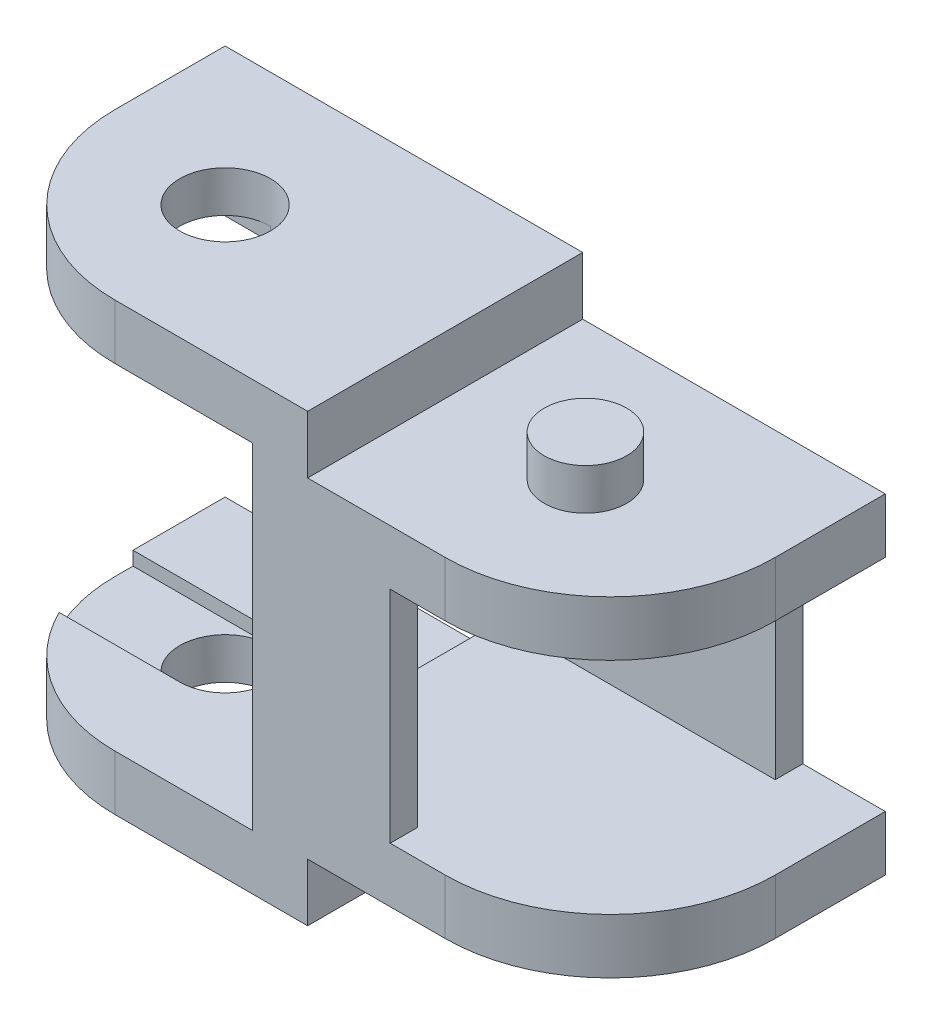
ISO-10303-21;
HEADER;
FILE_DESCRIPTION(('STEP AP214'),'2;1');
FILE_NAME('part.step','',(''),(''),'','','');
FILE_SCHEMA(('AUTOMOTIVE_DESIGN { 1 0 10303 214 1 1 1 1 }'));
ENDSEC;
DATA;
#1=APPLICATION_CONTEXT('core data for automotive mechanical design processes');
#2=APPLICATION_PROTOCOL_DEFINITION('international standard','automotive_design',2000,#1);
#3=PRODUCT_CONTEXT('',#1,'mechanical');
#4=PRODUCT('Part','Part','',(#3));
#5=PRODUCT_RELATED_PRODUCT_CATEGORY('part','',(#4));
#6=PRODUCT_DEFINITION_FORMATION('','',#4);
#7=PRODUCT_DEFINITION_CONTEXT('part definition',#1,'design');
#8=PRODUCT_DEFINITION('design','',#6,#7);
#9=PRODUCT_DEFINITION_SHAPE('','',#8);
#10=(LENGTH_UNIT() NAMED_UNIT(*) SI_UNIT(.MILLI.,.METRE.));
#11=(NAMED_UNIT(*) PLANE_ANGLE_UNIT() SI_UNIT($,.RADIAN.));
#12=(NAMED_UNIT(*) SI_UNIT($,.STERADIAN.) SOLID_ANGLE_UNIT());
#13=UNCERTAINTY_MEASURE_WITH_UNIT(LENGTH_MEASURE(1.E-05),#10,'distance_accuracy_value','');
#14=(GEOMETRIC_REPRESENTATION_CONTEXT(3) GLOBAL_UNCERTAINTY_ASSIGNED_CONTEXT((#13)) GLOBAL_UNIT_ASSIGNED_CONTEXT((#10,
#11,#12)) REPRESENTATION_CONTEXT('',''));
#15=CARTESIAN_POINT('',(0.,0.,0.));
#16=DIRECTION('',(0.,0.,1.));
#17=DIRECTION('',(1.,0.,0.));
#18=AXIS2_PLACEMENT_3D('',#15,#16,#17);
#19=CARTESIAN_POINT('',(5.,2.,5.));
#20=DIRECTION('',(0.,-1.,0.));
#21=DIRECTION('',(1.,0.,0.));
#22=AXIS2_PLACEMENT_3D('',#19,#20,#21);
#23=CYLINDRICAL_SURFACE('',#22,1.65);
#24=CARTESIAN_POINT('',(5.,2.,5.));
#25=DIRECTION('',(0.,-1.,0.));
#26=DIRECTION('',(1.,0.,0.));
#27=AXIS2_PLACEMENT_3D('',#24,#25,#26);
#28=CIRCLE('',#27,1.65);
#29=CARTESIAN_POINT('',(6.65,2.,5.));
#30=VERTEX_POINT('',#29);
#31=EDGE_CURVE('E493',#30,#30,#28,.T.);
#32=ORIENTED_EDGE('',*,*,#31,.F.);
#33=EDGE_LOOP('',(#32));
#34=FACE_BOUND('',#33,.T.);
#35=DIRECTION('',(0.,-1.,0.));
#36=VECTOR('',#35,1.);
#37=CARTESIAN_POINT('',(5.,0.5,3.35));
#38=LINE('',#37,#36);
#39=CARTESIAN_POINT('',(5.,0.5,3.35));
#40=VERTEX_POINT('',#39);
#41=CARTESIAN_POINT('',(5.,0.,3.35));
#42=VERTEX_POINT('',#41);
#43=EDGE_CURVE('E440',#40,#42,#38,.T.);
#44=ORIENTED_EDGE('',*,*,#43,.T.);
#45=CARTESIAN_POINT('',(5.,0.,5.));
#46=DIRECTION('',(0.,-1.,0.));
#47=DIRECTION('',(1.,0.,0.));
#48=AXIS2_PLACEMENT_3D('',#45,#46,#47);
#49=CIRCLE('',#48,1.65);
#50=CARTESIAN_POINT('',(5.,0.,6.65));
#51=VERTEX_POINT('',#50);
#52=EDGE_CURVE('E492',#42,#51,#49,.T.);
#53=ORIENTED_EDGE('',*,*,#52,.T.);
#54=DIRECTION('',(0.,-1.,0.));
#55=VECTOR('',#54,1.);
#56=CARTESIAN_POINT('',(5.,0.5,6.65));
#57=LINE('',#56,#55);
#58=CARTESIAN_POINT('',(5.,0.5,6.65));
#59=VERTEX_POINT('',#58);
#60=EDGE_CURVE('E435',#59,#51,#57,.T.);
#61=ORIENTED_EDGE('',*,*,#60,.F.);
#62=CARTESIAN_POINT('',(5.,0.5,5.));
#63=DIRECTION('',(0.,1.,0.));
#64=DIRECTION('',(-1.,0.,0.));
#65=AXIS2_PLACEMENT_3D('',#62,#63,#64);
#66=CIRCLE('',#65,1.65);
#67=EDGE_CURVE('E450',#59,#40,#66,.F.);
#68=ORIENTED_EDGE('',*,*,#67,.T.);
#69=EDGE_LOOP('',(#44,#53,#61,#68));
#70=FACE_BOUND('',#69,.T.);
#71=ADVANCED_FACE('F39',(#34,#70),#23,.F.);
#72=CARTESIAN_POINT('',(24.,-2.1,10.));
#73=DIRECTION('',(0.,1.,0.));
#74=DIRECTION('',(-1.,0.,0.));
#75=AXIS2_PLACEMENT_3D('',#72,#73,#74);
#76=PLANE('',#75);
#77=DIRECTION('',(0.,0.,1.));
#78=VECTOR('',#77,1.);
#79=CARTESIAN_POINT('',(16.,-2.1,9.));
#80=LINE('',#79,#78);
#81=CARTESIAN_POINT('',(16.,-2.1,9.));
#82=VERTEX_POINT('',#81);
#83=CARTESIAN_POINT('',(16.,-2.1,10.));
#84=VERTEX_POINT('',#83);
#85=EDGE_CURVE('E62',#82,#84,#80,.T.);
#86=ORIENTED_EDGE('',*,*,#85,.F.);
#87=DIRECTION('',(1.,0.,0.));
#88=VECTOR('',#87,1.);
#89=CARTESIAN_POINT('',(11.,-2.1,9.));
#90=LINE('',#89,#88);
#91=CARTESIAN_POINT('',(11.,-2.1,9.));
#92=VERTEX_POINT('',#91);
#93=EDGE_CURVE('E460',#92,#82,#90,.T.);
#94=ORIENTED_EDGE('',*,*,#93,.F.);
#95=DIRECTION('',(0.,0.,-1.));
#96=VECTOR('',#95,1.);
#97=CARTESIAN_POINT('',(11.,-2.1,10.));
#98=LINE('',#97,#96);
#99=CARTESIAN_POINT('',(11.,-2.1,1.));
#100=VERTEX_POINT('',#99);
#101=EDGE_CURVE('E572',#92,#100,#98,.T.);
#102=ORIENTED_EDGE('',*,*,#101,.T.);
#103=DIRECTION('',(-1.,0.,0.));
#104=VECTOR('',#103,1.);
#105=CARTESIAN_POINT('',(11.,-2.1,1.));
#106=LINE('',#105,#104);
#107=CARTESIAN_POINT('',(21.,-2.1,1.));
#108=VERTEX_POINT('',#107);
#109=EDGE_CURVE('E476',#108,#100,#106,.T.);
#110=ORIENTED_EDGE('',*,*,#109,.F.);
#111=DIRECTION('',(0.,0.,1.));
#112=VECTOR('',#111,1.);
#113=CARTESIAN_POINT('',(21.,-2.1,0.));
#114=LINE('',#113,#112);
#115=CARTESIAN_POINT('',(21.,-2.1,0.));
#116=VERTEX_POINT('',#115);
#117=EDGE_CURVE('E472',#116,#108,#114,.T.);
#118=ORIENTED_EDGE('',*,*,#117,.F.);
#119=DIRECTION('',(1.,0.,0.));
#120=VECTOR('',#119,1.);
#121=CARTESIAN_POINT('',(24.,-2.1,0.));
#122=LINE('',#121,#120);
#123=CARTESIAN_POINT('',(24.,-2.1,0.));
#124=VERTEX_POINT('',#123);
#125=EDGE_CURVE('E532',#116,#124,#122,.T.);
#126=ORIENTED_EDGE('',*,*,#125,.T.);
#127=DIRECTION('',(0.,0.,-1.));
#128=VECTOR('',#127,1.);
#129=CARTESIAN_POINT('',(24.,-2.1,10.));
#130=LINE('',#129,#128);
#131=CARTESIAN_POINT('',(24.,-2.1,4.));
#132=VERTEX_POINT('',#131);
#133=EDGE_CURVE('E568',#132,#124,#130,.T.);
#134=ORIENTED_EDGE('',*,*,#133,.F.);
#135=CARTESIAN_POINT('',(18.,-2.1,4.));
#136=DIRECTION('',(0.,1.,0.));
#137=DIRECTION('',(-1.,0.,0.));
#138=AXIS2_PLACEMENT_3D('',#135,#136,#137);
#139=CIRCLE('',#138,6.);
#140=CARTESIAN_POINT('',(18.,-2.1,10.));
#141=VERTEX_POINT('',#140);
#142=EDGE_CURVE('E597',#132,#141,#139,.F.);
#143=ORIENTED_EDGE('',*,*,#142,.T.);
#144=DIRECTION('',(1.,0.,0.));
#145=VECTOR('',#144,1.);
#146=CARTESIAN_POINT('',(24.,-2.1,10.));
#147=LINE('',#146,#145);
#148=EDGE_CURVE('E512',#84,#141,#147,.T.);
#149=ORIENTED_EDGE('',*,*,#148,.F.);
#150=EDGE_LOOP('',(#86,#94,#102,#110,#118,#126,#134,#143,#149));
#151=FACE_BOUND('',#150,.T.);
#152=ADVANCED_FACE('F695',(#151),#76,.F.);
#153=CARTESIAN_POINT('',(11.,0.,10.));
#154=DIRECTION('',(0.,1.,0.));
#155=DIRECTION('',(-1.,0.,0.));
#156=AXIS2_PLACEMENT_3D('',#153,#154,#155);
#157=PLANE('',#156);
#158=ORIENTED_EDGE('',*,*,#52,.F.);
#159=DIRECTION('',(1.,0.,0.));
#160=VECTOR('',#159,1.);
#161=CARTESIAN_POINT('',(-0.689599517111065,0.,3.35));
#162=LINE('',#161,#160);
#163=CARTESIAN_POINT('',(0.,0.,3.35));
#164=VERTEX_POINT('',#163);
#165=EDGE_CURVE('E432',#164,#42,#162,.T.);
#166=ORIENTED_EDGE('',*,*,#165,.F.);
#167=DIRECTION('',(0.,0.,-1.));
#168=VECTOR('',#167,1.);
#169=CARTESIAN_POINT('',(0.,0.,10.));
#170=LINE('',#169,#168);
#171=CARTESIAN_POINT('',(0.,0.,0.));
#172=VERTEX_POINT('',#171);
#173=EDGE_CURVE('E525',#164,#172,#170,.T.);
#174=ORIENTED_EDGE('',*,*,#173,.T.);
#175=DIRECTION('',(1.,0.,0.));
#176=VECTOR('',#175,1.);
#177=CARTESIAN_POINT('',(11.,0.,0.));
#178=LINE('',#177,#176);
#179=CARTESIAN_POINT('',(11.,0.,0.));
#180=VERTEX_POINT('',#179);
#181=EDGE_CURVE('E504',#172,#180,#178,.T.);
#182=ORIENTED_EDGE('',*,*,#181,.T.);
#183=DIRECTION('',(0.,0.,-1.));
#184=VECTOR('',#183,1.);
#185=CARTESIAN_POINT('',(11.,0.,10.));
#186=LINE('',#185,#184);
#187=CARTESIAN_POINT('',(11.,0.,10.));
#188=VERTEX_POINT('',#187);
#189=EDGE_CURVE('E575',#188,#180,#186,.T.);
#190=ORIENTED_EDGE('',*,*,#189,.F.);
#191=DIRECTION('',(1.,0.,0.));
#192=VECTOR('',#191,1.);
#193=CARTESIAN_POINT('',(11.,0.,10.));
#194=LINE('',#193,#192);
#195=CARTESIAN_POINT('',(6.,0.,10.));
#196=VERTEX_POINT('',#195);
#197=EDGE_CURVE('E505',#196,#188,#194,.T.);
#198=ORIENTED_EDGE('',*,*,#197,.F.);
#199=CARTESIAN_POINT('',(6.,0.,4.));
#200=DIRECTION('',(0.,1.,0.));
#201=DIRECTION('',(-1.,0.,0.));
#202=AXIS2_PLACEMENT_3D('',#199,#200,#201);
#203=CIRCLE('',#202,6.);
#204=CARTESIAN_POINT('',(0.616924670785296,0.,6.65));
#205=VERTEX_POINT('',#204);
#206=EDGE_CURVE('E601',#196,#205,#203,.F.);
#207=ORIENTED_EDGE('',*,*,#206,.T.);
#208=DIRECTION('',(-1.,0.,0.));
#209=VECTOR('',#208,1.);
#210=CARTESIAN_POINT('',(-0.689599517111065,0.,6.65));
#211=LINE('',#210,#209);
#212=EDGE_CURVE('E428',#51,#205,#211,.T.);
#213=ORIENTED_EDGE('',*,*,#212,.F.);
#214=EDGE_LOOP('',(#158,#166,#174,#182,#190,#198,#207,#213));
#215=FACE_BOUND('',#214,.T.);
#216=ADVANCED_FACE('F645',(#215),#157,.F.);
#217=CARTESIAN_POINT('',(11.,-2.1,10.));
#218=DIRECTION('',(1.,0.,0.));
#219=DIRECTION('',(0.,0.,-1.));
#220=AXIS2_PLACEMENT_3D('',#217,#218,#219);
#221=PLANE('',#220);
#222=DIRECTION('',(0.,-1.,0.));
#223=VECTOR('',#222,1.);
#224=CARTESIAN_POINT('',(11.,-2.1,0.));
#225=LINE('',#224,#223);
#226=CARTESIAN_POINT('',(11.,-12.2,0.));
#227=VERTEX_POINT('',#226);
#228=EDGE_CURVE('E529',#180,#227,#225,.T.);
#229=ORIENTED_EDGE('',*,*,#228,.T.);
#230=DIRECTION('',(0.,0.,-1.));
#231=VECTOR('',#230,1.);
#232=CARTESIAN_POINT('',(11.,-12.2,10.));
#233=LINE('',#232,#231);
#234=CARTESIAN_POINT('',(11.,-12.2,10.));
#235=VERTEX_POINT('',#234);
#236=EDGE_CURVE('E389',#235,#227,#233,.T.);
#237=ORIENTED_EDGE('',*,*,#236,.F.);
#238=DIRECTION('',(0.,-1.,0.));
#239=VECTOR('',#238,1.);
#240=CARTESIAN_POINT('',(11.,-2.1,10.));
#241=LINE('',#240,#239);
#242=EDGE_CURVE('E508',#188,#235,#241,.T.);
#243=ORIENTED_EDGE('',*,*,#242,.F.);
#244=ORIENTED_EDGE('',*,*,#189,.T.);
#245=EDGE_LOOP('',(#229,#237,#243,#244));
#246=FACE_BOUND('',#245,.T.);
#247=DIRECTION('',(0.,0.,-1.));
#248=VECTOR('',#247,1.);
#249=CARTESIAN_POINT('',(11.,-10.1,10.));
#250=LINE('',#249,#248);
#251=CARTESIAN_POINT('',(11.,-10.1,9.));
#252=VERTEX_POINT('',#251);
#253=CARTESIAN_POINT('',(11.,-10.1,1.));
#254=VERTEX_POINT('',#253);
#255=EDGE_CURVE('E385',#252,#254,#250,.T.);
#256=ORIENTED_EDGE('',*,*,#255,.T.);
#257=DIRECTION('',(0.,1.,0.));
#258=VECTOR('',#257,1.);
#259=CARTESIAN_POINT('',(11.,-6.1,1.));
#260=LINE('',#259,#258);
#261=EDGE_CURVE('E484',#254,#100,#260,.T.);
#262=ORIENTED_EDGE('',*,*,#261,.T.);
#263=ORIENTED_EDGE('',*,*,#101,.F.);
#264=DIRECTION('',(0.,1.,0.));
#265=VECTOR('',#264,1.);
#266=CARTESIAN_POINT('',(11.,-6.1,9.));
#267=LINE('',#266,#265);
#268=EDGE_CURVE('E466',#252,#92,#267,.T.);
#269=ORIENTED_EDGE('',*,*,#268,.F.);
#270=EDGE_LOOP('',(#256,#262,#263,#269));
#271=FACE_BOUND('',#270,.T.);
#272=ADVANCED_FACE('F659',(#246,#271),#221,.F.);
#273=CARTESIAN_POINT('',(24.,-0.0999999999999997,10.));
#274=DIRECTION('',(-1.,0.,0.));
#275=DIRECTION('',(0.,0.,1.));
#276=AXIS2_PLACEMENT_3D('',#273,#274,#275);
#277=PLANE('',#276);
#278=DIRECTION('',(0.,0.,-1.));
#279=VECTOR('',#278,1.);
#280=CARTESIAN_POINT('',(24.,-0.0999999999999997,10.));
#281=LINE('',#280,#279);
#282=CARTESIAN_POINT('',(24.,-0.0999999999999997,4.));
#283=VERTEX_POINT('',#282);
#284=CARTESIAN_POINT('',(24.,-0.0999999999999997,0.));
#285=VERTEX_POINT('',#284);
#286=EDGE_CURVE('E565',#283,#285,#281,.T.);
#287=ORIENTED_EDGE('',*,*,#286,.F.);
#288=DIRECTION('',(0.,1.,0.));
#289=VECTOR('',#288,1.);
#290=CARTESIAN_POINT('',(24.,-0.0999999999999997,4.));
#291=LINE('',#290,#289);
#292=EDGE_CURVE('E594',#283,#132,#291,.F.);
#293=ORIENTED_EDGE('',*,*,#292,.T.);
#294=ORIENTED_EDGE('',*,*,#133,.T.);
#295=DIRECTION('',(0.,1.,0.));
#296=VECTOR('',#295,1.);
#297=CARTESIAN_POINT('',(24.,-0.0999999999999997,0.));
#298=LINE('',#297,#296);
#299=EDGE_CURVE('E535',#124,#285,#298,.T.);
#300=ORIENTED_EDGE('',*,*,#299,.T.);
#301=EDGE_LOOP('',(#287,#293,#294,#300));
#302=FACE_BOUND('',#301,.T.);
#303=ADVANCED_FACE('F709',(#302),#277,.F.);
#304=CARTESIAN_POINT('',(13.,-0.0999999999999997,10.));
#305=DIRECTION('',(0.,-1.,0.));
#306=DIRECTION('',(0.,0.,-1.));
#307=AXIS2_PLACEMENT_3D('',#304,#305,#306);
#308=PLANE('',#307);
#309=CARTESIAN_POINT('',(18.1,-0.0999999999999998,5.));
#310=DIRECTION('',(0.,-1.,0.));
#311=DIRECTION('',(0.,0.,-1.));
#312=AXIS2_PLACEMENT_3D('',#309,#310,#311);
#313=CIRCLE('',#312,1.5);
#314=CARTESIAN_POINT('',(18.1,-0.0999999999999998,3.5));
#315=VERTEX_POINT('',#314);
#316=EDGE_CURVE('E579',#315,#315,#313,.F.);
#317=ORIENTED_EDGE('',*,*,#316,.F.);
#318=EDGE_LOOP('',(#317));
#319=FACE_BOUND('',#318,.T.);
#320=DIRECTION('',(-1.,0.,0.));
#321=VECTOR('',#320,1.);
#322=CARTESIAN_POINT('',(13.,-0.0999999999999997,10.));
#323=LINE('',#322,#321);
#324=CARTESIAN_POINT('',(18.,-0.0999999999999997,10.));
#325=VERTEX_POINT('',#324);
#326=CARTESIAN_POINT('',(13.,-0.0999999999999997,10.));
#327=VERTEX_POINT('',#326);
#328=EDGE_CURVE('E515',#325,#327,#323,.T.);
#329=ORIENTED_EDGE('',*,*,#328,.F.);
#330=CARTESIAN_POINT('',(18.,-0.0999999999999997,4.));
#331=DIRECTION('',(0.,-1.,0.));
#332=DIRECTION('',(0.,0.,-1.));
#333=AXIS2_PLACEMENT_3D('',#330,#331,#332);
#334=CIRCLE('',#333,6.);
#335=EDGE_CURVE('E591',#325,#283,#334,.F.);
#336=ORIENTED_EDGE('',*,*,#335,.T.);
#337=ORIENTED_EDGE('',*,*,#286,.T.);
#338=DIRECTION('',(-1.,0.,0.));
#339=VECTOR('',#338,1.);
#340=CARTESIAN_POINT('',(13.,-0.0999999999999997,0.));
#341=LINE('',#340,#339);
#342=CARTESIAN_POINT('',(13.,-0.0999999999999997,0.));
#343=VERTEX_POINT('',#342);
#344=EDGE_CURVE('E539',#285,#343,#341,.T.);
#345=ORIENTED_EDGE('',*,*,#344,.T.);
#346=DIRECTION('',(0.,0.,-1.));
#347=VECTOR('',#346,1.);
#348=CARTESIAN_POINT('',(13.,-0.0999999999999997,10.));
#349=LINE('',#348,#347);
#350=EDGE_CURVE('E561',#327,#343,#349,.T.);
#351=ORIENTED_EDGE('',*,*,#350,.F.);
#352=EDGE_LOOP('',(#329,#336,#337,#345,#351));
#353=FACE_BOUND('',#352,.T.);
#354=ADVANCED_FACE('F704',(#319,#353),#308,.F.);
#355=CARTESIAN_POINT('',(13.,2.,10.));
#356=DIRECTION('',(-1.,0.,0.));
#357=DIRECTION('',(0.,0.,1.));
#358=AXIS2_PLACEMENT_3D('',#355,#356,#357);
#359=PLANE('',#358);
#360=DIRECTION('',(0.,1.,0.));
#361=VECTOR('',#360,1.);
#362=CARTESIAN_POINT('',(13.,2.,0.));
#363=LINE('',#362,#361);
#364=CARTESIAN_POINT('',(13.,2.,0.));
#365=VERTEX_POINT('',#364);
#366=EDGE_CURVE('E542',#343,#365,#363,.T.);
#367=ORIENTED_EDGE('',*,*,#366,.T.);
#368=DIRECTION('',(0.,0.,-1.));
#369=VECTOR('',#368,1.);
#370=CARTESIAN_POINT('',(13.,2.,10.));
#371=LINE('',#370,#369);
#372=CARTESIAN_POINT('',(13.,2.,10.));
#373=VERTEX_POINT('',#372);
#374=EDGE_CURVE('E557',#373,#365,#371,.T.);
#375=ORIENTED_EDGE('',*,*,#374,.F.);
#376=DIRECTION('',(0.,1.,0.));
#377=VECTOR('',#376,1.);
#378=CARTESIAN_POINT('',(13.,2.,10.));
#379=LINE('',#378,#377);
#380=EDGE_CURVE('E518',#327,#373,#379,.T.);
#381=ORIENTED_EDGE('',*,*,#380,.F.);
#382=ORIENTED_EDGE('',*,*,#350,.T.);
#383=EDGE_LOOP('',(#367,#375,#381,#382));
#384=FACE_BOUND('',#383,.T.);
#385=ADVANCED_FACE('F634',(#384),#359,.F.);
#386=CARTESIAN_POINT('',(0.,2.,10.));
#387=DIRECTION('',(0.,-1.,0.));
#388=DIRECTION('',(1.,0.,0.));
#389=AXIS2_PLACEMENT_3D('',#386,#387,#388);
#390=PLANE('',#389);
#391=ORIENTED_EDGE('',*,*,#31,.T.);
#392=EDGE_LOOP('',(#391));
#393=FACE_BOUND('',#392,.T.);
#394=DIRECTION('',(0.,0.,-1.));
#395=VECTOR('',#394,1.);
#396=CARTESIAN_POINT('',(0.,2.,10.));
#397=LINE('',#396,#395);
#398=CARTESIAN_POINT('',(0.,2.,4.));
#399=VERTEX_POINT('',#398);
#400=CARTESIAN_POINT('',(0.,2.,0.));
#401=VERTEX_POINT('',#400);
#402=EDGE_CURVE('E554',#399,#401,#397,.T.);
#403=ORIENTED_EDGE('',*,*,#402,.F.);
#404=CARTESIAN_POINT('',(6.,2.,4.));
#405=DIRECTION('',(0.,-1.,0.));
#406=DIRECTION('',(1.,0.,0.));
#407=AXIS2_PLACEMENT_3D('',#404,#405,#406);
#408=CIRCLE('',#407,6.);
#409=CARTESIAN_POINT('',(6.,2.,10.));
#410=VERTEX_POINT('',#409);
#411=EDGE_CURVE('E608',#399,#410,#408,.F.);
#412=ORIENTED_EDGE('',*,*,#411,.T.);
#413=DIRECTION('',(-1.,0.,0.));
#414=VECTOR('',#413,1.);
#415=CARTESIAN_POINT('',(0.,2.,10.));
#416=LINE('',#415,#414);
#417=EDGE_CURVE('E521',#373,#410,#416,.T.);
#418=ORIENTED_EDGE('',*,*,#417,.F.);
#419=ORIENTED_EDGE('',*,*,#374,.T.);
#420=DIRECTION('',(-1.,0.,0.));
#421=VECTOR('',#420,1.);
#422=CARTESIAN_POINT('',(0.,2.,0.));
#423=LINE('',#422,#421);
#424=EDGE_CURVE('E545',#365,#401,#423,.T.);
#425=ORIENTED_EDGE('',*,*,#424,.T.);
#426=EDGE_LOOP('',(#403,#412,#418,#419,#425));
#427=FACE_BOUND('',#426,.T.);
#428=ADVANCED_FACE('F625',(#393,#427),#390,.F.);
#429=CARTESIAN_POINT('',(0.,0.,10.));
#430=DIRECTION('',(1.,0.,0.));
#431=DIRECTION('',(0.,0.,-1.));
#432=AXIS2_PLACEMENT_3D('',#429,#430,#431);
#433=PLANE('',#432);
#434=ORIENTED_EDGE('',*,*,#173,.F.);
#435=DIRECTION('',(0.,1.,0.));
#436=VECTOR('',#435,1.);
#437=CARTESIAN_POINT('',(0.,0.,3.35));
#438=LINE('',#437,#436);
#439=CARTESIAN_POINT('',(0.,0.5,3.35));
#440=VERTEX_POINT('',#439);
#441=EDGE_CURVE('E454',#164,#440,#438,.T.);
#442=ORIENTED_EDGE('',*,*,#441,.T.);
#443=DIRECTION('',(0.,0.,1.));
#444=VECTOR('',#443,1.);
#445=CARTESIAN_POINT('',(0.,0.5,10.));
#446=LINE('',#445,#444);
#447=CARTESIAN_POINT('',(0.,0.5,4.));
#448=VERTEX_POINT('',#447);
#449=EDGE_CURVE('E444',#440,#448,#446,.T.);
#450=ORIENTED_EDGE('',*,*,#449,.T.);
#451=DIRECTION('',(0.,-1.,0.));
#452=VECTOR('',#451,1.);
#453=CARTESIAN_POINT('',(0.,0.,4.));
#454=LINE('',#453,#452);
#455=EDGE_CURVE('E605',#448,#399,#454,.F.);
#456=ORIENTED_EDGE('',*,*,#455,.T.);
#457=ORIENTED_EDGE('',*,*,#402,.T.);
#458=DIRECTION('',(0.,-1.,0.));
#459=VECTOR('',#458,1.);
#460=CARTESIAN_POINT('',(0.,0.,0.));
#461=LINE('',#460,#459);
#462=EDGE_CURVE('E509',#401,#172,#461,.T.);
#463=ORIENTED_EDGE('',*,*,#462,.T.);
#464=EDGE_LOOP('',(#434,#442,#450,#456,#457,#463));
#465=FACE_BOUND('',#464,.T.);
#466=ADVANCED_FACE('F619',(#465),#433,.F.);
#467=CARTESIAN_POINT('',(0.,0.,10.));
#468=DIRECTION('',(0.,0.,-1.));
#469=DIRECTION('',(-1.,0.,0.));
#470=AXIS2_PLACEMENT_3D('',#467,#468,#469);
#471=PLANE('',#470);
#472=ORIENTED_EDGE('',*,*,#242,.T.);
#473=DIRECTION('',(1.,0.,0.));
#474=VECTOR('',#473,1.);
#475=CARTESIAN_POINT('',(11.,-12.2,10.));
#476=LINE('',#475,#474);
#477=CARTESIAN_POINT('',(6.,-12.2,10.));
#478=VERTEX_POINT('',#477);
#479=EDGE_CURVE('E316',#478,#235,#476,.T.);
#480=ORIENTED_EDGE('',*,*,#479,.F.);
#481=DIRECTION('',(0.,1.,0.));
#482=VECTOR('',#481,1.);
#483=CARTESIAN_POINT('',(6.,-12.2,10.));
#484=LINE('',#483,#482);
#485=CARTESIAN_POINT('',(6.,-14.2,10.));
#486=VERTEX_POINT('',#485);
#487=EDGE_CURVE('E396',#486,#478,#484,.T.);
#488=ORIENTED_EDGE('',*,*,#487,.F.);
#489=DIRECTION('',(-1.,0.,0.));
#490=VECTOR('',#489,1.);
#491=CARTESIAN_POINT('',(0.,-14.2,10.));
#492=LINE('',#491,#490);
#493=CARTESIAN_POINT('',(13.,-14.2,10.));
#494=VERTEX_POINT('',#493);
#495=EDGE_CURVE('E333',#494,#486,#492,.T.);
#496=ORIENTED_EDGE('',*,*,#495,.F.);
#497=DIRECTION('',(0.,-1.,0.));
#498=VECTOR('',#497,1.);
#499=CARTESIAN_POINT('',(13.,-14.2,10.));
#500=LINE('',#499,#498);
#501=CARTESIAN_POINT('',(13.,-12.1,10.));
#502=VERTEX_POINT('',#501);
#503=EDGE_CURVE('E329',#502,#494,#500,.T.);
#504=ORIENTED_EDGE('',*,*,#503,.F.);
#505=DIRECTION('',(-1.,0.,0.));
#506=VECTOR('',#505,1.);
#507=CARTESIAN_POINT('',(13.,-12.1,10.));
#508=LINE('',#507,#506);
#509=CARTESIAN_POINT('',(18.,-12.1,10.));
#510=VERTEX_POINT('',#509);
#511=EDGE_CURVE('E325',#510,#502,#508,.T.);
#512=ORIENTED_EDGE('',*,*,#511,.F.);
#513=DIRECTION('',(0.,-1.,0.));
#514=VECTOR('',#513,1.);
#515=CARTESIAN_POINT('',(18.,-12.2,10.));
#516=LINE('',#515,#514);
#517=CARTESIAN_POINT('',(18.,-10.1,10.));
#518=VERTEX_POINT('',#517);
#519=EDGE_CURVE('E399',#518,#510,#516,.T.);
#520=ORIENTED_EDGE('',*,*,#519,.F.);
#521=DIRECTION('',(1.,0.,0.));
#522=VECTOR('',#521,1.);
#523=CARTESIAN_POINT('',(24.,-10.1,10.));
#524=LINE('',#523,#522);
#525=CARTESIAN_POINT('',(16.,-10.1,10.));
#526=VERTEX_POINT('',#525);
#527=EDGE_CURVE('E320',#526,#518,#524,.T.);
#528=ORIENTED_EDGE('',*,*,#527,.F.);
#529=DIRECTION('',(0.,1.,0.));
#530=VECTOR('',#529,1.);
#531=CARTESIAN_POINT('',(16.,-6.1,10.));
#532=LINE('',#531,#530);
#533=EDGE_CURVE('E469',#526,#84,#532,.T.);
#534=ORIENTED_EDGE('',*,*,#533,.T.);
#535=ORIENTED_EDGE('',*,*,#148,.T.);
#536=DIRECTION('',(0.,1.,0.));
#537=VECTOR('',#536,1.);
#538=CARTESIAN_POINT('',(18.,0.,10.));
#539=LINE('',#538,#537);
#540=EDGE_CURVE('E587',#141,#325,#539,.T.);
#541=ORIENTED_EDGE('',*,*,#540,.T.);
#542=ORIENTED_EDGE('',*,*,#328,.T.);
#543=ORIENTED_EDGE('',*,*,#380,.T.);
#544=ORIENTED_EDGE('',*,*,#417,.T.);
#545=DIRECTION('',(0.,-1.,0.));
#546=VECTOR('',#545,1.);
#547=CARTESIAN_POINT('',(6.,0.,10.));
#548=LINE('',#547,#546);
#549=EDGE_CURVE('E583',#410,#196,#548,.T.);
#550=ORIENTED_EDGE('',*,*,#549,.T.);
#551=ORIENTED_EDGE('',*,*,#197,.T.);
#552=EDGE_LOOP('',(#472,#480,#488,#496,#504,#512,#520,#528,#534,#535,#541,#542,#543,#544,#550,#551));
#553=FACE_BOUND('',#552,.T.);
#554=ADVANCED_FACE('F627',(#553),#471,.F.);
#555=CARTESIAN_POINT('',(0.,0.,0.));
#556=DIRECTION('',(0.,0.,-1.));
#557=DIRECTION('',(-1.,0.,0.));
#558=AXIS2_PLACEMENT_3D('',#555,#556,#557);
#559=PLANE('',#558);
#560=ORIENTED_EDGE('',*,*,#181,.F.);
#561=ORIENTED_EDGE('',*,*,#462,.F.);
#562=ORIENTED_EDGE('',*,*,#424,.F.);
#563=ORIENTED_EDGE('',*,*,#366,.F.);
#564=ORIENTED_EDGE('',*,*,#344,.F.);
#565=ORIENTED_EDGE('',*,*,#299,.F.);
#566=ORIENTED_EDGE('',*,*,#125,.F.);
#567=DIRECTION('',(0.,1.,0.));
#568=VECTOR('',#567,1.);
#569=CARTESIAN_POINT('',(21.,-6.1,0.));
#570=LINE('',#569,#568);
#571=CARTESIAN_POINT('',(21.,-10.1,0.));
#572=VERTEX_POINT('',#571);
#573=EDGE_CURVE('E480',#572,#116,#570,.T.);
#574=ORIENTED_EDGE('',*,*,#573,.F.);
#575=DIRECTION('',(1.,0.,0.));
#576=VECTOR('',#575,1.);
#577=CARTESIAN_POINT('',(24.,-10.1,0.));
#578=LINE('',#577,#576);
#579=CARTESIAN_POINT('',(24.,-10.1,0.));
#580=VERTEX_POINT('',#579);
#581=EDGE_CURVE('E341',#572,#580,#578,.T.);
#582=ORIENTED_EDGE('',*,*,#581,.T.);
#583=DIRECTION('',(0.,-1.,0.));
#584=VECTOR('',#583,1.);
#585=CARTESIAN_POINT('',(24.,-12.1,0.));
#586=LINE('',#585,#584);
#587=CARTESIAN_POINT('',(24.,-12.1,0.));
#588=VERTEX_POINT('',#587);
#589=EDGE_CURVE('E345',#580,#588,#586,.T.);
#590=ORIENTED_EDGE('',*,*,#589,.T.);
#591=DIRECTION('',(-1.,0.,0.));
#592=VECTOR('',#591,1.);
#593=CARTESIAN_POINT('',(13.,-12.1,0.));
#594=LINE('',#593,#592);
#595=CARTESIAN_POINT('',(13.,-12.1,0.));
#596=VERTEX_POINT('',#595);
#597=EDGE_CURVE('E348',#588,#596,#594,.T.);
#598=ORIENTED_EDGE('',*,*,#597,.T.);
#599=DIRECTION('',(0.,-1.,0.));
#600=VECTOR('',#599,1.);
#601=CARTESIAN_POINT('',(13.,-14.2,0.));
#602=LINE('',#601,#600);
#603=CARTESIAN_POINT('',(13.,-14.2,0.));
#604=VERTEX_POINT('',#603);
#605=EDGE_CURVE('E352',#596,#604,#602,.T.);
#606=ORIENTED_EDGE('',*,*,#605,.T.);
#607=DIRECTION('',(-1.,0.,0.));
#608=VECTOR('',#607,1.);
#609=CARTESIAN_POINT('',(0.,-14.2,0.));
#610=LINE('',#609,#608);
#611=CARTESIAN_POINT('',(0.,-14.2,0.));
#612=VERTEX_POINT('',#611);
#613=EDGE_CURVE('E356',#604,#612,#610,.T.);
#614=ORIENTED_EDGE('',*,*,#613,.T.);
#615=DIRECTION('',(0.,1.,0.));
#616=VECTOR('',#615,1.);
#617=CARTESIAN_POINT('',(0.,-12.2,0.));
#618=LINE('',#617,#616);
#619=CARTESIAN_POINT('',(0.,-12.2,0.));
#620=VERTEX_POINT('',#619);
#621=EDGE_CURVE('E321',#612,#620,#618,.T.);
#622=ORIENTED_EDGE('',*,*,#621,.T.);
#623=DIRECTION('',(1.,0.,0.));
#624=VECTOR('',#623,1.);
#625=CARTESIAN_POINT('',(11.,-12.2,0.));
#626=LINE('',#625,#624);
#627=EDGE_CURVE('E315',#620,#227,#626,.T.);
#628=ORIENTED_EDGE('',*,*,#627,.T.);
#629=ORIENTED_EDGE('',*,*,#228,.F.);
#630=EDGE_LOOP('',(#560,#561,#562,#563,#564,#565,#566,#574,#582,#590,#598,#606,#614,#622,#628,#629));
#631=FACE_BOUND('',#630,.T.);
#632=ADVANCED_FACE('F640',(#631),#559,.T.);
#633=CARTESIAN_POINT('',(18.1,1.4,5.));
#634=DIRECTION('',(0.,-1.,0.));
#635=DIRECTION('',(0.,0.,-1.));
#636=AXIS2_PLACEMENT_3D('',#633,#634,#635);
#637=CYLINDRICAL_SURFACE('',#636,1.5);
#638=CARTESIAN_POINT('',(18.1,1.4,5.));
#639=DIRECTION('',(0.,1.,0.));
#640=DIRECTION('',(0.,0.,1.));
#641=AXIS2_PLACEMENT_3D('',#638,#639,#640);
#642=CIRCLE('',#641,1.5);
#643=CARTESIAN_POINT('',(18.1,1.4,6.5));
#644=VERTEX_POINT('',#643);
#645=EDGE_CURVE('E497',#644,#644,#642,.T.);
#646=ORIENTED_EDGE('',*,*,#645,.F.);
#647=EDGE_LOOP('',(#646));
#648=FACE_BOUND('',#647,.T.);
#649=ORIENTED_EDGE('',*,*,#316,.T.);
#650=EDGE_LOOP('',(#649));
#651=FACE_BOUND('',#650,.T.);
#652=ADVANCED_FACE('F734',(#648,#651),#637,.T.);
#653=CARTESIAN_POINT('',(18.1,1.4,5.));
#654=DIRECTION('',(0.,1.,0.));
#655=DIRECTION('',(0.,0.,1.));
#656=AXIS2_PLACEMENT_3D('',#653,#654,#655);
#657=PLANE('',#656);
#658=ORIENTED_EDGE('',*,*,#645,.T.);
#659=EDGE_LOOP('',(#658));
#660=FACE_BOUND('',#659,.T.);
#661=ADVANCED_FACE('F731',(#660),#657,.T.);
#662=CARTESIAN_POINT('',(18.,0.,4.));
#663=DIRECTION('',(0.,1.,0.));
#664=DIRECTION('',(0.,0.,1.));
#665=AXIS2_PLACEMENT_3D('',#662,#663,#664);
#666=CYLINDRICAL_SURFACE('',#665,6.);
#667=ORIENTED_EDGE('',*,*,#142,.F.);
#668=ORIENTED_EDGE('',*,*,#292,.F.);
#669=ORIENTED_EDGE('',*,*,#335,.F.);
#670=ORIENTED_EDGE('',*,*,#540,.F.);
#671=EDGE_LOOP('',(#667,#668,#669,#670));
#672=FACE_BOUND('',#671,.T.);
#673=ADVANCED_FACE('F702',(#672),#666,.T.);
#674=CARTESIAN_POINT('',(6.,0.,4.));
#675=DIRECTION('',(0.,-1.,0.));
#676=DIRECTION('',(0.,0.,-1.));
#677=AXIS2_PLACEMENT_3D('',#674,#675,#676);
#678=CYLINDRICAL_SURFACE('',#677,6.);
#679=DIRECTION('',(0.,-1.,0.));
#680=VECTOR('',#679,1.);
#681=CARTESIAN_POINT('',(0.616924670785296,0.,6.65));
#682=LINE('',#681,#680);
#683=CARTESIAN_POINT('',(0.616924670785296,0.5,6.65));
#684=VERTEX_POINT('',#683);
#685=EDGE_CURVE('E11',#205,#684,#682,.F.);
#686=ORIENTED_EDGE('',*,*,#685,.F.);
#687=ORIENTED_EDGE('',*,*,#206,.F.);
#688=ORIENTED_EDGE('',*,*,#549,.F.);
#689=ORIENTED_EDGE('',*,*,#411,.F.);
#690=ORIENTED_EDGE('',*,*,#455,.F.);
#691=CARTESIAN_POINT('',(6.,0.5,4.));
#692=DIRECTION('',(0.,1.,0.));
#693=DIRECTION('',(-1.,0.,0.));
#694=AXIS2_PLACEMENT_3D('',#691,#692,#693);
#695=CIRCLE('',#694,6.);
#696=EDGE_CURVE('E48',#684,#448,#695,.F.);
#697=ORIENTED_EDGE('',*,*,#696,.F.);
#698=EDGE_LOOP('',(#686,#687,#688,#689,#690,#697));
#699=FACE_BOUND('',#698,.T.);
#700=ADVANCED_FACE('F41',(#699),#678,.T.);
#701=CARTESIAN_POINT('',(21.,-6.1,0.));
#702=DIRECTION('',(-1.,0.,0.));
#703=DIRECTION('',(0.,-1.,0.));
#704=AXIS2_PLACEMENT_3D('',#701,#702,#703);
#705=PLANE('',#704);
#706=ORIENTED_EDGE('',*,*,#117,.T.);
#707=DIRECTION('',(0.,1.,0.));
#708=VECTOR('',#707,1.);
#709=CARTESIAN_POINT('',(21.,-6.1,1.));
#710=LINE('',#709,#708);
#711=CARTESIAN_POINT('',(21.,-10.1,1.));
#712=VERTEX_POINT('',#711);
#713=EDGE_CURVE('E488',#712,#108,#710,.T.);
#714=ORIENTED_EDGE('',*,*,#713,.F.);
#715=DIRECTION('',(0.,0.,1.));
#716=VECTOR('',#715,1.);
#717=CARTESIAN_POINT('',(21.,-10.1,0.));
#718=LINE('',#717,#716);
#719=EDGE_CURVE('E296',#572,#712,#718,.T.);
#720=ORIENTED_EDGE('',*,*,#719,.F.);
#721=ORIENTED_EDGE('',*,*,#573,.T.);
#722=EDGE_LOOP('',(#706,#714,#720,#721));
#723=FACE_BOUND('',#722,.T.);
#724=ADVANCED_FACE('F729',(#723),#705,.F.);
#725=CARTESIAN_POINT('',(11.,-6.1,1.));
#726=DIRECTION('',(0.,0.,-1.));
#727=DIRECTION('',(-1.,0.,0.));
#728=AXIS2_PLACEMENT_3D('',#725,#726,#727);
#729=PLANE('',#728);
#730=ORIENTED_EDGE('',*,*,#109,.T.);
#731=ORIENTED_EDGE('',*,*,#261,.F.);
#732=DIRECTION('',(-1.,0.,0.));
#733=VECTOR('',#732,1.);
#734=CARTESIAN_POINT('',(11.,-10.1,1.));
#735=LINE('',#734,#733);
#736=EDGE_CURVE('E300',#712,#254,#735,.T.);
#737=ORIENTED_EDGE('',*,*,#736,.F.);
#738=ORIENTED_EDGE('',*,*,#713,.T.);
#739=EDGE_LOOP('',(#730,#731,#737,#738));
#740=FACE_BOUND('',#739,.T.);
#741=ADVANCED_FACE('F784',(#740),#729,.F.);
#742=CARTESIAN_POINT('',(16.,-6.1,9.));
#743=DIRECTION('',(-1.,0.,0.));
#744=DIRECTION('',(0.,-1.,0.));
#745=AXIS2_PLACEMENT_3D('',#742,#743,#744);
#746=PLANE('',#745);
#747=ORIENTED_EDGE('',*,*,#85,.T.);
#748=ORIENTED_EDGE('',*,*,#533,.F.);
#749=DIRECTION('',(0.,0.,1.));
#750=VECTOR('',#749,1.);
#751=CARTESIAN_POINT('',(16.,-10.1,9.));
#752=LINE('',#751,#750);
#753=CARTESIAN_POINT('',(16.,-10.1,9.));
#754=VERTEX_POINT('',#753);
#755=EDGE_CURVE('E284',#754,#526,#752,.T.);
#756=ORIENTED_EDGE('',*,*,#755,.F.);
#757=DIRECTION('',(0.,1.,0.));
#758=VECTOR('',#757,1.);
#759=CARTESIAN_POINT('',(16.,-6.1,9.));
#760=LINE('',#759,#758);
#761=EDGE_CURVE('E463',#754,#82,#760,.T.);
#762=ORIENTED_EDGE('',*,*,#761,.T.);
#763=EDGE_LOOP('',(#747,#748,#756,#762));
#764=FACE_BOUND('',#763,.T.);
#765=ADVANCED_FACE('F790',(#764),#746,.F.);
#766=CARTESIAN_POINT('',(11.,-6.1,9.));
#767=DIRECTION('',(0.,0.,1.));
#768=DIRECTION('',(1.,0.,0.));
#769=AXIS2_PLACEMENT_3D('',#766,#767,#768);
#770=PLANE('',#769);
#771=ORIENTED_EDGE('',*,*,#93,.T.);
#772=ORIENTED_EDGE('',*,*,#761,.F.);
#773=DIRECTION('',(1.,0.,0.));
#774=VECTOR('',#773,1.);
#775=CARTESIAN_POINT('',(11.,-10.1,9.));
#776=LINE('',#775,#774);
#777=EDGE_CURVE('E292',#252,#754,#776,.T.);
#778=ORIENTED_EDGE('',*,*,#777,.F.);
#779=ORIENTED_EDGE('',*,*,#268,.T.);
#780=EDGE_LOOP('',(#771,#772,#778,#779));
#781=FACE_BOUND('',#780,.T.);
#782=ADVANCED_FACE('F796',(#781),#770,.F.);
#783=CARTESIAN_POINT('',(-0.689599517111065,0.5,3.35));
#784=DIRECTION('',(0.,0.,-1.));
#785=DIRECTION('',(-1.,0.,0.));
#786=AXIS2_PLACEMENT_3D('',#783,#784,#785);
#787=PLANE('',#786);
#788=ORIENTED_EDGE('',*,*,#165,.T.);
#789=ORIENTED_EDGE('',*,*,#43,.F.);
#790=DIRECTION('',(1.,0.,0.));
#791=VECTOR('',#790,1.);
#792=CARTESIAN_POINT('',(-0.689599517111065,0.5,3.35));
#793=LINE('',#792,#791);
#794=EDGE_CURVE('E431',#440,#40,#793,.T.);
#795=ORIENTED_EDGE('',*,*,#794,.F.);
#796=ORIENTED_EDGE('',*,*,#441,.F.);
#797=EDGE_LOOP('',(#788,#789,#795,#796));
#798=FACE_BOUND('',#797,.T.);
#799=ADVANCED_FACE('F650',(#798),#787,.F.);
#800=CARTESIAN_POINT('',(0.,0.5,0.));
#801=DIRECTION('',(0.,1.,0.));
#802=DIRECTION('',(-1.,0.,0.));
#803=AXIS2_PLACEMENT_3D('',#800,#801,#802);
#804=PLANE('',#803);
#805=DIRECTION('',(-1.,0.,0.));
#806=VECTOR('',#805,1.);
#807=CARTESIAN_POINT('',(-0.689599517111065,0.5,6.65));
#808=LINE('',#807,#806);
#809=EDGE_CURVE('E55',#59,#684,#808,.T.);
#810=ORIENTED_EDGE('',*,*,#809,.T.);
#811=ORIENTED_EDGE('',*,*,#696,.T.);
#812=ORIENTED_EDGE('',*,*,#449,.F.);
#813=ORIENTED_EDGE('',*,*,#794,.T.);
#814=ORIENTED_EDGE('',*,*,#67,.F.);
#815=EDGE_LOOP('',(#810,#811,#812,#813,#814));
#816=FACE_BOUND('',#815,.T.);
#817=ADVANCED_FACE('F612',(#816),#804,.F.);
#818=CARTESIAN_POINT('',(-0.689599517111065,0.5,6.65));
#819=DIRECTION('',(0.,0.,1.));
#820=DIRECTION('',(1.,0.,0.));
#821=AXIS2_PLACEMENT_3D('',#818,#819,#820);
#822=PLANE('',#821);
#823=ORIENTED_EDGE('',*,*,#685,.T.);
#824=ORIENTED_EDGE('',*,*,#809,.F.);
#825=ORIENTED_EDGE('',*,*,#60,.T.);
#826=ORIENTED_EDGE('',*,*,#212,.T.);
#827=EDGE_LOOP('',(#823,#824,#825,#826));
#828=FACE_BOUND('',#827,.T.);
#829=ADVANCED_FACE('F654',(#828),#822,.F.);
#830=CARTESIAN_POINT('',(5.,-14.2,5.));
#831=DIRECTION('',(0.,1.,0.));
#832=DIRECTION('',(1.,0.,0.));
#833=AXIS2_PLACEMENT_3D('',#830,#831,#832);
#834=CYLINDRICAL_SURFACE('',#833,1.65);
#835=CARTESIAN_POINT('',(5.,-14.2,5.));
#836=DIRECTION('',(0.,-1.,0.));
#837=DIRECTION('',(1.,0.,0.));
#838=AXIS2_PLACEMENT_3D('',#835,#836,#837);
#839=CIRCLE('',#838,1.65);
#840=CARTESIAN_POINT('',(6.65,-14.2,5.));
#841=VERTEX_POINT('',#840);
#842=EDGE_CURVE('E305',#841,#841,#839,.T.);
#843=ORIENTED_EDGE('',*,*,#842,.T.);
#844=EDGE_LOOP('',(#843));
#845=FACE_BOUND('',#844,.T.);
#846=DIRECTION('',(0.,1.,0.));
#847=VECTOR('',#846,1.);
#848=CARTESIAN_POINT('',(5.,-12.7,3.35));
#849=LINE('',#848,#847);
#850=CARTESIAN_POINT('',(5.,-12.7,3.35));
#851=VERTEX_POINT('',#850);
#852=CARTESIAN_POINT('',(5.,-12.2,3.35));
#853=VERTEX_POINT('',#852);
#854=EDGE_CURVE('E272',#851,#853,#849,.T.);
#855=ORIENTED_EDGE('',*,*,#854,.F.);
#856=CARTESIAN_POINT('',(5.,-12.7,5.));
#857=DIRECTION('',(0.,1.,0.));
#858=DIRECTION('',(-1.,0.,0.));
#859=AXIS2_PLACEMENT_3D('',#856,#857,#858);
#860=CIRCLE('',#859,1.65);
#861=CARTESIAN_POINT('',(5.,-12.7,6.65));
#862=VERTEX_POINT('',#861);
#863=EDGE_CURVE('E253',#862,#851,#860,.F.);
#864=ORIENTED_EDGE('',*,*,#863,.F.);
#865=DIRECTION('',(0.,1.,0.));
#866=VECTOR('',#865,1.);
#867=CARTESIAN_POINT('',(5.,-12.7,6.65));
#868=LINE('',#867,#866);
#869=CARTESIAN_POINT('',(5.,-12.2,6.65));
#870=VERTEX_POINT('',#869);
#871=EDGE_CURVE('E264',#862,#870,#868,.T.);
#872=ORIENTED_EDGE('',*,*,#871,.T.);
#873=CARTESIAN_POINT('',(5.,-12.2,5.));
#874=DIRECTION('',(0.,-1.,0.));
#875=DIRECTION('',(1.,0.,0.));
#876=AXIS2_PLACEMENT_3D('',#873,#874,#875);
#877=CIRCLE('',#876,1.65);
#878=EDGE_CURVE('E304',#853,#870,#877,.T.);
#879=ORIENTED_EDGE('',*,*,#878,.F.);
#880=EDGE_LOOP('',(#855,#864,#872,#879));
#881=FACE_BOUND('',#880,.T.);
#882=ADVANCED_FACE('F274',(#845,#881),#834,.F.);
#883=CARTESIAN_POINT('',(24.,-10.1,10.));
#884=DIRECTION('',(0.,-1.,0.));
#885=DIRECTION('',(-1.,0.,0.));
#886=AXIS2_PLACEMENT_3D('',#883,#884,#885);
#887=PLANE('',#886);
#888=ORIENTED_EDGE('',*,*,#755,.T.);
#889=ORIENTED_EDGE('',*,*,#527,.T.);
#890=CARTESIAN_POINT('',(18.,-10.1,4.));
#891=DIRECTION('',(0.,1.,0.));
#892=DIRECTION('',(-1.,0.,0.));
#893=AXIS2_PLACEMENT_3D('',#890,#891,#892);
#894=CIRCLE('',#893,6.);
#895=CARTESIAN_POINT('',(24.,-10.1,4.));
#896=VERTEX_POINT('',#895);
#897=EDGE_CURVE('E408',#896,#518,#894,.F.);
#898=ORIENTED_EDGE('',*,*,#897,.F.);
#899=DIRECTION('',(0.,0.,-1.));
#900=VECTOR('',#899,1.);
#901=CARTESIAN_POINT('',(24.,-10.1,10.));
#902=LINE('',#901,#900);
#903=EDGE_CURVE('E381',#896,#580,#902,.T.);
#904=ORIENTED_EDGE('',*,*,#903,.T.);
#905=ORIENTED_EDGE('',*,*,#581,.F.);
#906=ORIENTED_EDGE('',*,*,#719,.T.);
#907=ORIENTED_EDGE('',*,*,#736,.T.);
#908=ORIENTED_EDGE('',*,*,#255,.F.);
#909=ORIENTED_EDGE('',*,*,#777,.T.);
#910=EDGE_LOOP('',(#888,#889,#898,#904,#905,#906,#907,#908,#909));
#911=FACE_BOUND('',#910,.T.);
#912=ADVANCED_FACE('F691',(#911),#887,.F.);
#913=CARTESIAN_POINT('',(11.,-12.2,10.));
#914=DIRECTION('',(0.,-1.,0.));
#915=DIRECTION('',(-1.,0.,0.));
#916=AXIS2_PLACEMENT_3D('',#913,#914,#915);
#917=PLANE('',#916);
#918=ORIENTED_EDGE('',*,*,#878,.T.);
#919=DIRECTION('',(-1.,0.,0.));
#920=VECTOR('',#919,1.);
#921=CARTESIAN_POINT('',(-0.689599517111064,-12.2,6.65));
#922=LINE('',#921,#920);
#923=CARTESIAN_POINT('',(0.616924670785297,-12.2,6.65));
#924=VERTEX_POINT('',#923);
#925=EDGE_CURVE('E267',#870,#924,#922,.T.);
#926=ORIENTED_EDGE('',*,*,#925,.T.);
#927=CARTESIAN_POINT('',(6.,-12.2,4.));
#928=DIRECTION('',(0.,1.,0.));
#929=DIRECTION('',(-1.,0.,0.));
#930=AXIS2_PLACEMENT_3D('',#927,#928,#929);
#931=CIRCLE('',#930,6.);
#932=EDGE_CURVE('E412',#478,#924,#931,.F.);
#933=ORIENTED_EDGE('',*,*,#932,.F.);
#934=ORIENTED_EDGE('',*,*,#479,.T.);
#935=ORIENTED_EDGE('',*,*,#236,.T.);
#936=ORIENTED_EDGE('',*,*,#627,.F.);
#937=DIRECTION('',(0.,0.,-1.));
#938=VECTOR('',#937,1.);
#939=CARTESIAN_POINT('',(0.,-12.2,10.));
#940=LINE('',#939,#938);
#941=CARTESIAN_POINT('',(0.,-12.2,3.35));
#942=VERTEX_POINT('',#941);
#943=EDGE_CURVE('E337',#942,#620,#940,.T.);
#944=ORIENTED_EDGE('',*,*,#943,.F.);
#945=DIRECTION('',(1.,0.,0.));
#946=VECTOR('',#945,1.);
#947=CARTESIAN_POINT('',(-0.689599517111064,-12.2,3.35));
#948=LINE('',#947,#946);
#949=EDGE_CURVE('E261',#942,#853,#948,.T.);
#950=ORIENTED_EDGE('',*,*,#949,.T.);
#951=EDGE_LOOP('',(#918,#926,#933,#934,#935,#936,#944,#950));
#952=FACE_BOUND('',#951,.T.);
#953=ADVANCED_FACE('F664',(#952),#917,.F.);
#954=CARTESIAN_POINT('',(24.,-12.1,10.));
#955=DIRECTION('',(-1.,0.,0.));
#956=DIRECTION('',(0.,0.,1.));
#957=AXIS2_PLACEMENT_3D('',#954,#955,#956);
#958=PLANE('',#957);
#959=DIRECTION('',(0.,0.,-1.));
#960=VECTOR('',#959,1.);
#961=CARTESIAN_POINT('',(24.,-12.1,10.));
#962=LINE('',#961,#960);
#963=CARTESIAN_POINT('',(24.,-12.1,4.));
#964=VERTEX_POINT('',#963);
#965=EDGE_CURVE('E377',#964,#588,#962,.T.);
#966=ORIENTED_EDGE('',*,*,#965,.T.);
#967=ORIENTED_EDGE('',*,*,#589,.F.);
#968=ORIENTED_EDGE('',*,*,#903,.F.);
#969=DIRECTION('',(0.,-1.,0.));
#970=VECTOR('',#969,1.);
#971=CARTESIAN_POINT('',(24.,-12.1,4.));
#972=LINE('',#971,#970);
#973=EDGE_CURVE('E405',#964,#896,#972,.F.);
#974=ORIENTED_EDGE('',*,*,#973,.F.);
#975=EDGE_LOOP('',(#966,#967,#968,#974));
#976=FACE_BOUND('',#975,.T.);
#977=ADVANCED_FACE('F687',(#976),#958,.F.);
#978=CARTESIAN_POINT('',(13.,-12.1,10.));
#979=DIRECTION('',(0.,1.,0.));
#980=DIRECTION('',(0.,0.,-1.));
#981=AXIS2_PLACEMENT_3D('',#978,#979,#980);
#982=PLANE('',#981);
#983=CARTESIAN_POINT('',(18.1,-12.1,5.));
#984=DIRECTION('',(0.,-1.,0.));
#985=DIRECTION('',(0.,0.,-1.));
#986=AXIS2_PLACEMENT_3D('',#983,#984,#985);
#987=CIRCLE('',#986,1.5);
#988=CARTESIAN_POINT('',(18.1,-12.1,3.5));
#989=VERTEX_POINT('',#988);
#990=EDGE_CURVE('E393',#989,#989,#987,.F.);
#991=ORIENTED_EDGE('',*,*,#990,.T.);
#992=EDGE_LOOP('',(#991));
#993=FACE_BOUND('',#992,.T.);
#994=ORIENTED_EDGE('',*,*,#511,.T.);
#995=DIRECTION('',(0.,0.,-1.));
#996=VECTOR('',#995,1.);
#997=CARTESIAN_POINT('',(13.,-12.1,10.));
#998=LINE('',#997,#996);
#999=EDGE_CURVE('E373',#502,#596,#998,.T.);
#1000=ORIENTED_EDGE('',*,*,#999,.T.);
#1001=ORIENTED_EDGE('',*,*,#597,.F.);
#1002=ORIENTED_EDGE('',*,*,#965,.F.);
#1003=CARTESIAN_POINT('',(18.,-12.1,4.));
#1004=DIRECTION('',(0.,-1.,0.));
#1005=DIRECTION('',(0.,0.,-1.));
#1006=AXIS2_PLACEMENT_3D('',#1003,#1004,#1005);
#1007=CIRCLE('',#1006,6.);
#1008=EDGE_CURVE('E402',#510,#964,#1007,.F.);
#1009=ORIENTED_EDGE('',*,*,#1008,.F.);
#1010=EDGE_LOOP('',(#994,#1000,#1001,#1002,#1009));
#1011=FACE_BOUND('',#1010,.T.);
#1012=ADVANCED_FACE('F680',(#993,#1011),#982,.F.);
#1013=CARTESIAN_POINT('',(13.,-14.2,10.));
#1014=DIRECTION('',(-1.,0.,0.));
#1015=DIRECTION('',(0.,0.,1.));
#1016=AXIS2_PLACEMENT_3D('',#1013,#1014,#1015);
#1017=PLANE('',#1016);
#1018=ORIENTED_EDGE('',*,*,#605,.F.);
#1019=ORIENTED_EDGE('',*,*,#999,.F.);
#1020=ORIENTED_EDGE('',*,*,#503,.T.);
#1021=DIRECTION('',(0.,0.,-1.));
#1022=VECTOR('',#1021,1.);
#1023=CARTESIAN_POINT('',(13.,-14.2,10.));
#1024=LINE('',#1023,#1022);
#1025=EDGE_CURVE('E369',#494,#604,#1024,.T.);
#1026=ORIENTED_EDGE('',*,*,#1025,.T.);
#1027=EDGE_LOOP('',(#1018,#1019,#1020,#1026));
#1028=FACE_BOUND('',#1027,.T.);
#1029=ADVANCED_FACE('F675',(#1028),#1017,.F.);
#1030=CARTESIAN_POINT('',(0.,-14.2,10.));
#1031=DIRECTION('',(0.,1.,0.));
#1032=DIRECTION('',(1.,0.,0.));
#1033=AXIS2_PLACEMENT_3D('',#1030,#1031,#1032);
#1034=PLANE('',#1033);
#1035=ORIENTED_EDGE('',*,*,#842,.F.);
#1036=EDGE_LOOP('',(#1035));
#1037=FACE_BOUND('',#1036,.T.);
#1038=DIRECTION('',(0.,0.,-1.));
#1039=VECTOR('',#1038,1.);
#1040=CARTESIAN_POINT('',(0.,-14.2,10.));
#1041=LINE('',#1040,#1039);
#1042=CARTESIAN_POINT('',(0.,-14.2,4.));
#1043=VERTEX_POINT('',#1042);
#1044=EDGE_CURVE('E365',#1043,#612,#1041,.T.);
#1045=ORIENTED_EDGE('',*,*,#1044,.T.);
#1046=ORIENTED_EDGE('',*,*,#613,.F.);
#1047=ORIENTED_EDGE('',*,*,#1025,.F.);
#1048=ORIENTED_EDGE('',*,*,#495,.T.);
#1049=CARTESIAN_POINT('',(6.,-14.2,4.));
#1050=DIRECTION('',(0.,-1.,0.));
#1051=DIRECTION('',(1.,0.,0.));
#1052=AXIS2_PLACEMENT_3D('',#1049,#1050,#1051);
#1053=CIRCLE('',#1052,6.);
#1054=EDGE_CURVE('E419',#1043,#486,#1053,.F.);
#1055=ORIENTED_EDGE('',*,*,#1054,.F.);
#1056=EDGE_LOOP('',(#1045,#1046,#1047,#1048,#1055));
#1057=FACE_BOUND('',#1056,.T.);
#1058=ADVANCED_FACE('F672',(#1037,#1057),#1034,.F.);
#1059=CARTESIAN_POINT('',(0.,-12.2,10.));
#1060=DIRECTION('',(1.,0.,0.));
#1061=DIRECTION('',(0.,0.,-1.));
#1062=AXIS2_PLACEMENT_3D('',#1059,#1060,#1061);
#1063=PLANE('',#1062);
#1064=ORIENTED_EDGE('',*,*,#943,.T.);
#1065=ORIENTED_EDGE('',*,*,#621,.F.);
#1066=ORIENTED_EDGE('',*,*,#1044,.F.);
#1067=DIRECTION('',(0.,1.,0.));
#1068=VECTOR('',#1067,1.);
#1069=CARTESIAN_POINT('',(0.,-12.2,4.));
#1070=LINE('',#1069,#1068);
#1071=CARTESIAN_POINT('',(0.,-12.7,4.));
#1072=VERTEX_POINT('',#1071);
#1073=EDGE_CURVE('E416',#1072,#1043,#1070,.F.);
#1074=ORIENTED_EDGE('',*,*,#1073,.F.);
#1075=DIRECTION('',(0.,0.,1.));
#1076=VECTOR('',#1075,1.);
#1077=CARTESIAN_POINT('',(0.,-12.7,10.));
#1078=LINE('',#1077,#1076);
#1079=CARTESIAN_POINT('',(0.,-12.7,3.35));
#1080=VERTEX_POINT('',#1079);
#1081=EDGE_CURVE('E278',#1080,#1072,#1078,.T.);
#1082=ORIENTED_EDGE('',*,*,#1081,.F.);
#1083=DIRECTION('',(0.,-1.,0.));
#1084=VECTOR('',#1083,1.);
#1085=CARTESIAN_POINT('',(0.,-12.2,3.35));
#1086=LINE('',#1085,#1084);
#1087=EDGE_CURVE('E277',#942,#1080,#1086,.T.);
#1088=ORIENTED_EDGE('',*,*,#1087,.F.);
#1089=EDGE_LOOP('',(#1064,#1065,#1066,#1074,#1082,#1088));
#1090=FACE_BOUND('',#1089,.T.);
#1091=ADVANCED_FACE('F855',(#1090),#1063,.F.);
#1092=CARTESIAN_POINT('',(18.1,-13.6,5.));
#1093=DIRECTION('',(0.,1.,0.));
#1094=DIRECTION('',(0.,0.,-1.));
#1095=AXIS2_PLACEMENT_3D('',#1092,#1093,#1094);
#1096=CYLINDRICAL_SURFACE('',#1095,1.5);
#1097=CARTESIAN_POINT('',(18.1,-13.6,5.));
#1098=DIRECTION('',(0.,1.,0.));
#1099=DIRECTION('',(0.,0.,1.));
#1100=AXIS2_PLACEMENT_3D('',#1097,#1098,#1099);
#1101=CIRCLE('',#1100,1.5);
#1102=CARTESIAN_POINT('',(18.1,-13.6,6.5));
#1103=VERTEX_POINT('',#1102);
#1104=EDGE_CURVE('E309',#1103,#1103,#1101,.T.);
#1105=ORIENTED_EDGE('',*,*,#1104,.T.);
#1106=EDGE_LOOP('',(#1105));
#1107=FACE_BOUND('',#1106,.T.);
#1108=ORIENTED_EDGE('',*,*,#990,.F.);
#1109=EDGE_LOOP('',(#1108));
#1110=FACE_BOUND('',#1109,.T.);
#1111=ADVANCED_FACE('F862',(#1107,#1110),#1096,.T.);
#1112=CARTESIAN_POINT('',(18.1,-13.6,5.));
#1113=DIRECTION('',(0.,-1.,0.));
#1114=DIRECTION('',(0.,0.,1.));
#1115=AXIS2_PLACEMENT_3D('',#1112,#1113,#1114);
#1116=PLANE('',#1115);
#1117=ORIENTED_EDGE('',*,*,#1104,.F.);
#1118=EDGE_LOOP('',(#1117));
#1119=FACE_BOUND('',#1118,.T.);
#1120=ADVANCED_FACE('F869',(#1119),#1116,.T.);
#1121=CARTESIAN_POINT('',(18.,-12.2,4.));
#1122=DIRECTION('',(0.,-1.,0.));
#1123=DIRECTION('',(0.,0.,1.));
#1124=AXIS2_PLACEMENT_3D('',#1121,#1122,#1123);
#1125=CYLINDRICAL_SURFACE('',#1124,6.);
#1126=ORIENTED_EDGE('',*,*,#897,.T.);
#1127=ORIENTED_EDGE('',*,*,#519,.T.);
#1128=ORIENTED_EDGE('',*,*,#1008,.T.);
#1129=ORIENTED_EDGE('',*,*,#973,.T.);
#1130=EDGE_LOOP('',(#1126,#1127,#1128,#1129));
#1131=FACE_BOUND('',#1130,.T.);
#1132=ADVANCED_FACE('F684',(#1131),#1125,.T.);
#1133=CARTESIAN_POINT('',(6.,-12.2,4.));
#1134=DIRECTION('',(0.,1.,0.));
#1135=DIRECTION('',(0.,0.,-1.));
#1136=AXIS2_PLACEMENT_3D('',#1133,#1134,#1135);
#1137=CYLINDRICAL_SURFACE('',#1136,6.);
#1138=DIRECTION('',(0.,1.,0.));
#1139=VECTOR('',#1138,1.);
#1140=CARTESIAN_POINT('',(0.616924670785297,-12.2,6.65));
#1141=LINE('',#1140,#1139);
#1142=CARTESIAN_POINT('',(0.616924670785297,-12.7,6.65));
#1143=VERTEX_POINT('',#1142);
#1144=EDGE_CURVE('E425',#924,#1143,#1141,.F.);
#1145=ORIENTED_EDGE('',*,*,#1144,.T.);
#1146=CARTESIAN_POINT('',(6.,-12.7,4.));
#1147=DIRECTION('',(0.,1.,0.));
#1148=DIRECTION('',(-1.,0.,0.));
#1149=AXIS2_PLACEMENT_3D('',#1146,#1147,#1148);
#1150=CIRCLE('',#1149,6.);
#1151=EDGE_CURVE('E256',#1143,#1072,#1150,.F.);
#1152=ORIENTED_EDGE('',*,*,#1151,.T.);
#1153=ORIENTED_EDGE('',*,*,#1073,.T.);
#1154=ORIENTED_EDGE('',*,*,#1054,.T.);
#1155=ORIENTED_EDGE('',*,*,#487,.T.);
#1156=ORIENTED_EDGE('',*,*,#932,.T.);
#1157=EDGE_LOOP('',(#1145,#1152,#1153,#1154,#1155,#1156));
#1158=FACE_BOUND('',#1157,.T.);
#1159=ADVANCED_FACE('F668',(#1158),#1137,.T.);
#1160=CARTESIAN_POINT('',(-0.689599517111064,-12.7,3.35));
#1161=DIRECTION('',(0.,0.,-1.));
#1162=DIRECTION('',(-1.,0.,0.));
#1163=AXIS2_PLACEMENT_3D('',#1160,#1161,#1162);
#1164=PLANE('',#1163);
#1165=ORIENTED_EDGE('',*,*,#949,.F.);
#1166=ORIENTED_EDGE('',*,*,#1087,.T.);
#1167=DIRECTION('',(1.,0.,0.));
#1168=VECTOR('',#1167,1.);
#1169=CARTESIAN_POINT('',(-0.689599517111064,-12.7,3.35));
#1170=LINE('',#1169,#1168);
#1171=EDGE_CURVE('E260',#1080,#851,#1170,.T.);
#1172=ORIENTED_EDGE('',*,*,#1171,.T.);
#1173=ORIENTED_EDGE('',*,*,#854,.T.);
#1174=EDGE_LOOP('',(#1165,#1166,#1172,#1173));
#1175=FACE_BOUND('',#1174,.T.);
#1176=ADVANCED_FACE('F887',(#1175),#1164,.F.);
#1177=CARTESIAN_POINT('',(0.,-12.7,0.));
#1178=DIRECTION('',(0.,-1.,0.));
#1179=DIRECTION('',(-1.,0.,0.));
#1180=AXIS2_PLACEMENT_3D('',#1177,#1178,#1179);
#1181=PLANE('',#1180);
#1182=DIRECTION('',(-1.,0.,0.));
#1183=VECTOR('',#1182,1.);
#1184=CARTESIAN_POINT('',(-0.689599517111064,-12.7,6.65));
#1185=LINE('',#1184,#1183);
#1186=EDGE_CURVE('E249',#862,#1143,#1185,.T.);
#1187=ORIENTED_EDGE('',*,*,#1186,.F.);
#1188=ORIENTED_EDGE('',*,*,#863,.T.);
#1189=ORIENTED_EDGE('',*,*,#1171,.F.);
#1190=ORIENTED_EDGE('',*,*,#1081,.T.);
#1191=ORIENTED_EDGE('',*,*,#1151,.F.);
#1192=EDGE_LOOP('',(#1187,#1188,#1189,#1190,#1191));
#1193=FACE_BOUND('',#1192,.T.);
#1194=ADVANCED_FACE('F251',(#1193),#1181,.F.);
#1195=CARTESIAN_POINT('',(-0.689599517111064,-12.7,6.65));
#1196=DIRECTION('',(0.,0.,1.));
#1197=DIRECTION('',(1.,0.,0.));
#1198=AXIS2_PLACEMENT_3D('',#1195,#1196,#1197);
#1199=PLANE('',#1198);
#1200=ORIENTED_EDGE('',*,*,#1144,.F.);
#1201=ORIENTED_EDGE('',*,*,#925,.F.);
#1202=ORIENTED_EDGE('',*,*,#871,.F.);
#1203=ORIENTED_EDGE('',*,*,#1186,.T.);
#1204=EDGE_LOOP('',(#1200,#1201,#1202,#1203));
#1205=FACE_BOUND('',#1204,.T.);
#1206=ADVANCED_FACE('F265',(#1205),#1199,.F.);
#1207=CLOSED_SHELL('',(#71,#152,#216,#272,#303,#354,#385,#428,#466,#554,#632,#652,#661,#673,
#700,#724,#741,#765,#782,#799,#817,#829,#882,#912,#953,#977,#1012,#1029,#1058,#1091,#1111,#1120,
#1132,#1159,#1176,#1194,#1206));
#1208=MANIFOLD_SOLID_BREP('B2',#1207);
#1209=ADVANCED_BREP_SHAPE_REPRESENTATION('',(#18,#1208),#14);
#1210=SHAPE_DEFINITION_REPRESENTATION(#9,#1209);
ENDSEC;
END-ISO-10303-21;
